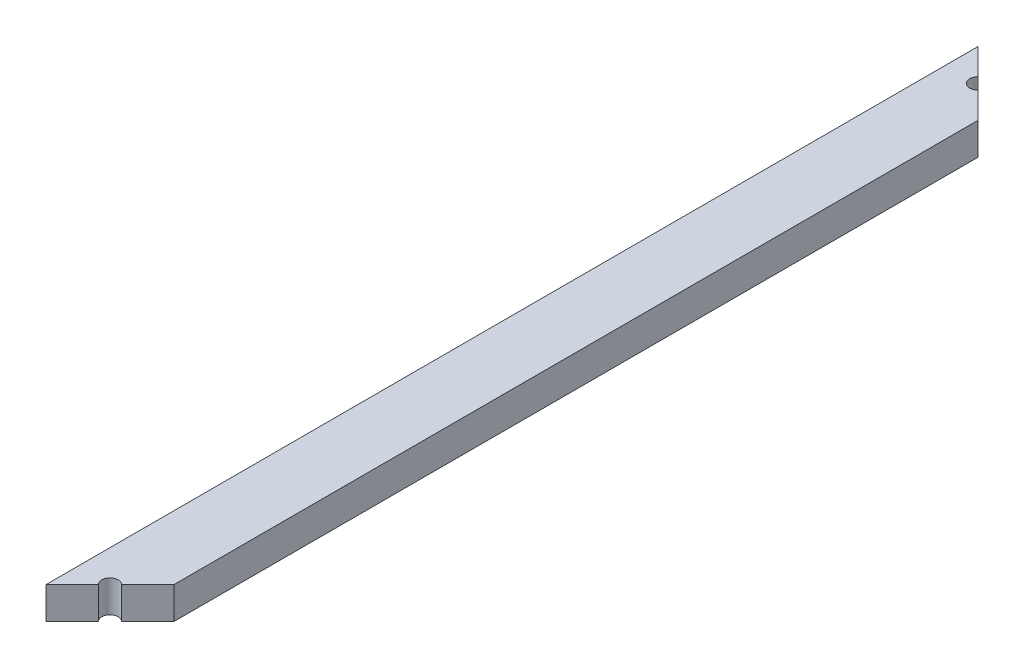
ISO-10303-21;
HEADER;
FILE_DESCRIPTION(('STEP AP214'),'2;1');
FILE_NAME('part.step','',(''),(''),'','','');
FILE_SCHEMA(('AUTOMOTIVE_DESIGN { 1 0 10303 214 1 1 1 1 }'));
ENDSEC;
DATA;
#1=APPLICATION_CONTEXT('core data for automotive mechanical design processes');
#2=APPLICATION_PROTOCOL_DEFINITION('international standard','automotive_design',2000,#1);
#3=PRODUCT_CONTEXT('',#1,'mechanical');
#4=PRODUCT('Part','Part','',(#3));
#5=PRODUCT_RELATED_PRODUCT_CATEGORY('part','',(#4));
#6=PRODUCT_DEFINITION_FORMATION('','',#4);
#7=PRODUCT_DEFINITION_CONTEXT('part definition',#1,'design');
#8=PRODUCT_DEFINITION('design','',#6,#7);
#9=PRODUCT_DEFINITION_SHAPE('','',#8);
#10=(LENGTH_UNIT() NAMED_UNIT(*) SI_UNIT(.MILLI.,.METRE.));
#11=(NAMED_UNIT(*) PLANE_ANGLE_UNIT() SI_UNIT($,.RADIAN.));
#12=(NAMED_UNIT(*) SI_UNIT($,.STERADIAN.) SOLID_ANGLE_UNIT());
#13=UNCERTAINTY_MEASURE_WITH_UNIT(LENGTH_MEASURE(1.E-05),#10,'distance_accuracy_value','');
#14=(GEOMETRIC_REPRESENTATION_CONTEXT(3) GLOBAL_UNCERTAINTY_ASSIGNED_CONTEXT((#13)) GLOBAL_UNIT_ASSIGNED_CONTEXT((#10,
#11,#12)) REPRESENTATION_CONTEXT('',''));
#15=CARTESIAN_POINT('',(0.,0.,0.));
#16=DIRECTION('',(0.,0.,1.));
#17=DIRECTION('',(1.,0.,0.));
#18=AXIS2_PLACEMENT_3D('',#15,#16,#17);
#19=CARTESIAN_POINT('',(0.,0.,204.));
#20=DIRECTION('',(-0.707106781186544,0.,-0.707106781186551));
#21=DIRECTION('',(-0.707106781186551,0.,0.707106781186544));
#22=AXIS2_PLACEMENT_3D('',#19,#20,#21);
#23=PLANE('',#22);
#24=DIRECTION('',(-0.707106781186551,0.,0.707106781186544));
#25=VECTOR('',#24,1.);
#26=CARTESIAN_POINT('',(0.,0.,204.));
#27=LINE('',#26,#25);
#28=CARTESIAN_POINT('',(5.72720779386418,0.,198.272792206136));
#29=VERTEX_POINT('',#28);
#30=CARTESIAN_POINT('',(0.,0.,204.));
#31=VERTEX_POINT('',#30);
#32=EDGE_CURVE('E108',#29,#31,#27,.T.);
#33=ORIENTED_EDGE('',*,*,#32,.F.);
#34=DIRECTION('',(0.,1.,0.));
#35=VECTOR('',#34,1.);
#36=CARTESIAN_POINT('',(5.72720779386418,0.,198.272792206136));
#37=LINE('',#36,#35);
#38=CARTESIAN_POINT('',(5.72720779386418,7.,198.272792206136));
#39=VERTEX_POINT('',#38);
#40=EDGE_CURVE('E96',#29,#39,#37,.T.);
#41=ORIENTED_EDGE('',*,*,#40,.T.);
#42=DIRECTION('',(-0.707106781186551,0.,0.707106781186544));
#43=VECTOR('',#42,1.);
#44=CARTESIAN_POINT('',(0.,7.,204.));
#45=LINE('',#44,#43);
#46=CARTESIAN_POINT('',(0.,7.,204.));
#47=VERTEX_POINT('',#46);
#48=EDGE_CURVE('E120',#39,#47,#45,.T.);
#49=ORIENTED_EDGE('',*,*,#48,.T.);
#50=DIRECTION('',(0.,-1.,0.));
#51=VECTOR('',#50,1.);
#52=CARTESIAN_POINT('',(0.,0.,204.));
#53=LINE('',#52,#51);
#54=EDGE_CURVE('E114',#47,#31,#53,.T.);
#55=ORIENTED_EDGE('',*,*,#54,.T.);
#56=EDGE_LOOP('',(#33,#41,#49,#55));
#57=FACE_BOUND('',#56,.T.);
#58=ADVANCED_FACE('F33',(#57),#23,.F.);
#59=CARTESIAN_POINT('',(0.,0.,0.));
#60=DIRECTION('',(-0.707106781186544,0.,0.707106781186551));
#61=DIRECTION('',(0.707106781186551,0.,0.707106781186544));
#62=AXIS2_PLACEMENT_3D('',#59,#60,#61);
#63=PLANE('',#62);
#64=DIRECTION('',(0.707106781186551,0.,0.707106781186544));
#65=VECTOR('',#64,1.);
#66=CARTESIAN_POINT('',(0.,0.,0.));
#67=LINE('',#66,#65);
#68=CARTESIAN_POINT('',(8.27279220613579,0.,8.27279220613569));
#69=VERTEX_POINT('',#68);
#70=CARTESIAN_POINT('',(14.,0.,13.9999999999998));
#71=VERTEX_POINT('',#70);
#72=EDGE_CURVE('E132',#69,#71,#67,.T.);
#73=ORIENTED_EDGE('',*,*,#72,.F.);
#74=DIRECTION('',(0.,1.,0.));
#75=VECTOR('',#74,1.);
#76=CARTESIAN_POINT('',(8.27279220613579,0.,8.27279220613569));
#77=LINE('',#76,#75);
#78=CARTESIAN_POINT('',(8.27279220613579,7.,8.27279220613569));
#79=VERTEX_POINT('',#78);
#80=EDGE_CURVE('E123',#69,#79,#77,.T.);
#81=ORIENTED_EDGE('',*,*,#80,.T.);
#82=DIRECTION('',(0.707106781186551,0.,0.707106781186544));
#83=VECTOR('',#82,1.);
#84=CARTESIAN_POINT('',(0.,7.,0.));
#85=LINE('',#84,#83);
#86=CARTESIAN_POINT('',(14.,7.,13.9999999999998));
#87=VERTEX_POINT('',#86);
#88=EDGE_CURVE('E127',#79,#87,#85,.T.);
#89=ORIENTED_EDGE('',*,*,#88,.T.);
#90=DIRECTION('',(0.,1.,0.));
#91=VECTOR('',#90,1.);
#92=CARTESIAN_POINT('',(14.,0.,13.9999999999998));
#93=LINE('',#92,#91);
#94=EDGE_CURVE('E131',#71,#87,#93,.T.);
#95=ORIENTED_EDGE('',*,*,#94,.F.);
#96=EDGE_LOOP('',(#73,#81,#89,#95));
#97=FACE_BOUND('',#96,.T.);
#98=ADVANCED_FACE('F155',(#97),#63,.F.);
#99=CARTESIAN_POINT('',(0.,0.,204.));
#100=DIRECTION('',(1.,0.,0.));
#101=DIRECTION('',(0.,0.,-1.));
#102=AXIS2_PLACEMENT_3D('',#99,#100,#101);
#103=PLANE('',#102);
#104=DIRECTION('',(0.,-1.,0.));
#105=VECTOR('',#104,1.);
#106=CARTESIAN_POINT('',(0.,0.,0.));
#107=LINE('',#106,#105);
#108=CARTESIAN_POINT('',(0.,7.,0.));
#109=VERTEX_POINT('',#108);
#110=CARTESIAN_POINT('',(0.,0.,0.));
#111=VERTEX_POINT('',#110);
#112=EDGE_CURVE('E138',#109,#111,#107,.T.);
#113=ORIENTED_EDGE('',*,*,#112,.T.);
#114=DIRECTION('',(0.,0.,-1.));
#115=VECTOR('',#114,1.);
#116=CARTESIAN_POINT('',(0.,0.,204.));
#117=LINE('',#116,#115);
#118=EDGE_CURVE('E11',#31,#111,#117,.T.);
#119=ORIENTED_EDGE('',*,*,#118,.F.);
#120=ORIENTED_EDGE('',*,*,#54,.F.);
#121=DIRECTION('',(0.,0.,-1.));
#122=VECTOR('',#121,1.);
#123=CARTESIAN_POINT('',(0.,7.,204.));
#124=LINE('',#123,#122);
#125=EDGE_CURVE('E140',#47,#109,#124,.T.);
#126=ORIENTED_EDGE('',*,*,#125,.T.);
#127=EDGE_LOOP('',(#113,#119,#120,#126));
#128=FACE_BOUND('',#127,.T.);
#129=ADVANCED_FACE('F35',(#128),#103,.F.);
#130=CARTESIAN_POINT('',(0.,0.,204.));
#131=DIRECTION('',(0.,1.,0.));
#132=DIRECTION('',(0.,0.,1.));
#133=AXIS2_PLACEMENT_3D('',#130,#131,#132);
#134=PLANE('',#133);
#135=CARTESIAN_POINT('',(14.,0.,190.));
#136=VERTEX_POINT('',#135);
#137=CARTESIAN_POINT('',(8.27279220613581,0.,195.727207793864));
#138=VERTEX_POINT('',#137);
#139=EDGE_CURVE('E111',#136,#138,#27,.T.);
#140=ORIENTED_EDGE('',*,*,#139,.T.);
#141=CARTESIAN_POINT('',(7.00000000000001,0.,197.));
#142=DIRECTION('',(0.,1.,0.));
#143=DIRECTION('',(0.,0.,-1.));
#144=AXIS2_PLACEMENT_3D('',#141,#142,#143);
#145=CIRCLE('',#144,1.80000000000001);
#146=EDGE_CURVE('E48',#138,#29,#145,.T.);
#147=ORIENTED_EDGE('',*,*,#146,.T.);
#148=ORIENTED_EDGE('',*,*,#32,.T.);
#149=ORIENTED_EDGE('',*,*,#118,.T.);
#150=CARTESIAN_POINT('',(5.7272077938642,0.,5.72720779386413));
#151=VERTEX_POINT('',#150);
#152=EDGE_CURVE('E128',#111,#151,#67,.T.);
#153=ORIENTED_EDGE('',*,*,#152,.T.);
#154=CARTESIAN_POINT('',(7.,0.,6.99999999999991));
#155=DIRECTION('',(0.,1.,0.));
#156=DIRECTION('',(0.,0.,1.));
#157=AXIS2_PLACEMENT_3D('',#154,#155,#156);
#158=CIRCLE('',#157,1.8);
#159=EDGE_CURVE('E56',#151,#69,#158,.T.);
#160=ORIENTED_EDGE('',*,*,#159,.T.);
#161=ORIENTED_EDGE('',*,*,#72,.T.);
#162=DIRECTION('',(0.,0.,-1.));
#163=VECTOR('',#162,1.);
#164=CARTESIAN_POINT('',(14.,0.,204.));
#165=LINE('',#164,#163);
#166=EDGE_CURVE('E41',#136,#71,#165,.T.);
#167=ORIENTED_EDGE('',*,*,#166,.F.);
#168=EDGE_LOOP('',(#140,#147,#148,#149,#153,#160,#161,#167));
#169=FACE_BOUND('',#168,.T.);
#170=ADVANCED_FACE('F107',(#169),#134,.F.);
#171=CARTESIAN_POINT('',(14.,0.,204.));
#172=DIRECTION('',(-1.,0.,0.));
#173=DIRECTION('',(0.,0.,1.));
#174=AXIS2_PLACEMENT_3D('',#171,#172,#173);
#175=PLANE('',#174);
#176=DIRECTION('',(0.,0.,-1.));
#177=VECTOR('',#176,1.);
#178=CARTESIAN_POINT('',(14.,7.,204.));
#179=LINE('',#178,#177);
#180=CARTESIAN_POINT('',(14.,7.,190.));
#181=VERTEX_POINT('',#180);
#182=EDGE_CURVE('E145',#181,#87,#179,.T.);
#183=ORIENTED_EDGE('',*,*,#182,.F.);
#184=DIRECTION('',(0.,1.,0.));
#185=VECTOR('',#184,1.);
#186=CARTESIAN_POINT('',(14.,0.,190.));
#187=LINE('',#186,#185);
#188=EDGE_CURVE('E118',#136,#181,#187,.T.);
#189=ORIENTED_EDGE('',*,*,#188,.F.);
#190=ORIENTED_EDGE('',*,*,#166,.T.);
#191=ORIENTED_EDGE('',*,*,#94,.T.);
#192=EDGE_LOOP('',(#183,#189,#190,#191));
#193=FACE_BOUND('',#192,.T.);
#194=ADVANCED_FACE('F152',(#193),#175,.F.);
#195=CARTESIAN_POINT('',(0.,7.,204.));
#196=DIRECTION('',(0.,-1.,0.));
#197=DIRECTION('',(0.,0.,-1.));
#198=AXIS2_PLACEMENT_3D('',#195,#196,#197);
#199=PLANE('',#198);
#200=ORIENTED_EDGE('',*,*,#48,.F.);
#201=CARTESIAN_POINT('',(7.00000000000001,7.,197.));
#202=DIRECTION('',(0.,1.,0.));
#203=DIRECTION('',(0.,0.,-1.));
#204=AXIS2_PLACEMENT_3D('',#201,#202,#203);
#205=CIRCLE('',#204,1.80000000000001);
#206=CARTESIAN_POINT('',(8.2727922061358,7.,195.727207793864));
#207=VERTEX_POINT('',#206);
#208=EDGE_CURVE('E99',#207,#39,#205,.T.);
#209=ORIENTED_EDGE('',*,*,#208,.F.);
#210=EDGE_CURVE('E116',#181,#207,#45,.T.);
#211=ORIENTED_EDGE('',*,*,#210,.F.);
#212=ORIENTED_EDGE('',*,*,#182,.T.);
#213=ORIENTED_EDGE('',*,*,#88,.F.);
#214=CARTESIAN_POINT('',(7.,7.,6.99999999999991));
#215=DIRECTION('',(0.,1.,0.));
#216=DIRECTION('',(0.,0.,1.));
#217=AXIS2_PLACEMENT_3D('',#214,#215,#216);
#218=CIRCLE('',#217,1.8);
#219=CARTESIAN_POINT('',(5.72720779386421,7.,5.72720779386413));
#220=VERTEX_POINT('',#219);
#221=EDGE_CURVE('E164',#220,#79,#218,.T.);
#222=ORIENTED_EDGE('',*,*,#221,.F.);
#223=EDGE_CURVE('E133',#109,#220,#85,.T.);
#224=ORIENTED_EDGE('',*,*,#223,.F.);
#225=ORIENTED_EDGE('',*,*,#125,.F.);
#226=EDGE_LOOP('',(#200,#209,#211,#212,#213,#222,#224,#225));
#227=FACE_BOUND('',#226,.T.);
#228=ADVANCED_FACE('F161',(#227),#199,.F.);
#229=ORIENTED_EDGE('',*,*,#223,.T.);
#230=DIRECTION('',(0.,1.,0.));
#231=VECTOR('',#230,1.);
#232=CARTESIAN_POINT('',(5.72720779386421,0.,5.72720779386413));
#233=LINE('',#232,#231);
#234=EDGE_CURVE('E169',#151,#220,#233,.T.);
#235=ORIENTED_EDGE('',*,*,#234,.F.);
#236=ORIENTED_EDGE('',*,*,#152,.F.);
#237=ORIENTED_EDGE('',*,*,#112,.F.);
#238=EDGE_LOOP('',(#229,#235,#236,#237));
#239=FACE_BOUND('',#238,.T.);
#240=ADVANCED_FACE('F174',(#239),#63,.F.);
#241=ORIENTED_EDGE('',*,*,#210,.T.);
#242=DIRECTION('',(0.,1.,0.));
#243=VECTOR('',#242,1.);
#244=CARTESIAN_POINT('',(8.2727922061358,0.,195.727207793864));
#245=LINE('',#244,#243);
#246=EDGE_CURVE('E103',#138,#207,#245,.T.);
#247=ORIENTED_EDGE('',*,*,#246,.F.);
#248=ORIENTED_EDGE('',*,*,#139,.F.);
#249=ORIENTED_EDGE('',*,*,#188,.T.);
#250=EDGE_LOOP('',(#241,#247,#248,#249));
#251=FACE_BOUND('',#250,.T.);
#252=ADVANCED_FACE('F163',(#251),#23,.F.);
#253=CARTESIAN_POINT('',(7.,0.,6.99999999999991));
#254=DIRECTION('',(0.,1.,0.));
#255=DIRECTION('',(0.,0.,1.));
#256=AXIS2_PLACEMENT_3D('',#253,#254,#255);
#257=CYLINDRICAL_SURFACE('',#256,1.8);
#258=ORIENTED_EDGE('',*,*,#221,.T.);
#259=ORIENTED_EDGE('',*,*,#80,.F.);
#260=ORIENTED_EDGE('',*,*,#159,.F.);
#261=ORIENTED_EDGE('',*,*,#234,.T.);
#262=EDGE_LOOP('',(#258,#259,#260,#261));
#263=FACE_BOUND('',#262,.T.);
#264=ADVANCED_FACE('F181',(#263),#257,.F.);
#265=CARTESIAN_POINT('',(7.00000000000001,0.,197.));
#266=DIRECTION('',(0.,1.,0.));
#267=DIRECTION('',(0.,0.,1.));
#268=AXIS2_PLACEMENT_3D('',#265,#266,#267);
#269=CYLINDRICAL_SURFACE('',#268,1.80000000000001);
#270=ORIENTED_EDGE('',*,*,#208,.T.);
#271=ORIENTED_EDGE('',*,*,#40,.F.);
#272=ORIENTED_EDGE('',*,*,#146,.F.);
#273=ORIENTED_EDGE('',*,*,#246,.T.);
#274=EDGE_LOOP('',(#270,#271,#272,#273));
#275=FACE_BOUND('',#274,.T.);
#276=ADVANCED_FACE('F97',(#275),#269,.F.);
#277=CLOSED_SHELL('',(#58,#98,#129,#170,#194,#228,#240,#252,#264,#276));
#278=MANIFOLD_SOLID_BREP('B2',#277);
#279=ADVANCED_BREP_SHAPE_REPRESENTATION('',(#18,#278),#14);
#280=SHAPE_DEFINITION_REPRESENTATION(#9,#279);
ENDSEC;
END-ISO-10303-21;
